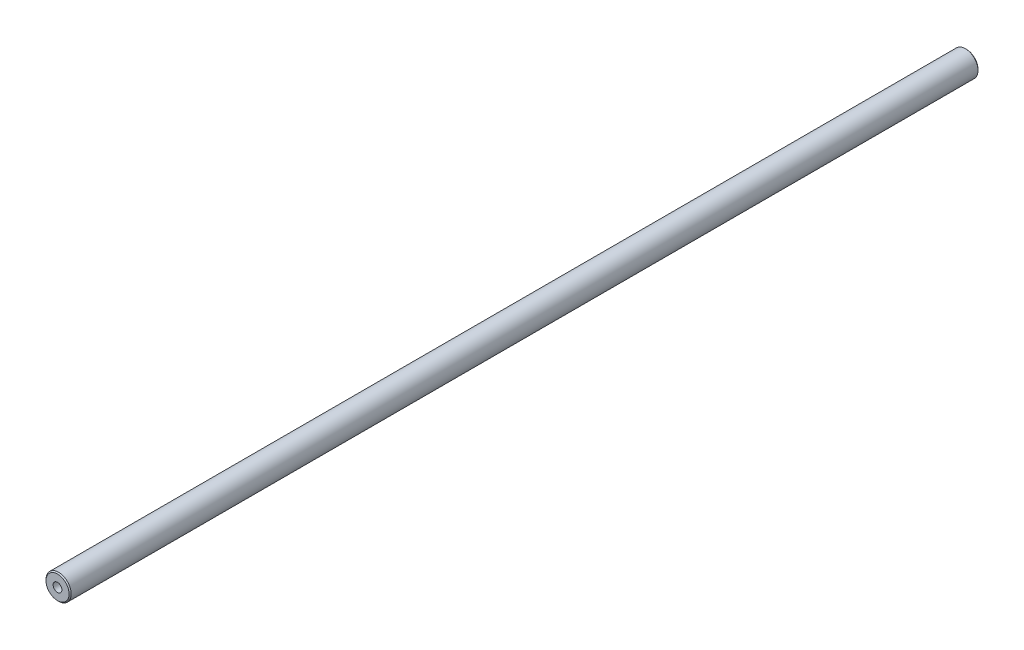
ISO-10303-21;
HEADER;
FILE_DESCRIPTION(('STEP AP214'),'2;1');
FILE_NAME('part.step','',(''),(''),'','','');
FILE_SCHEMA(('AUTOMOTIVE_DESIGN { 1 0 10303 214 1 1 1 1 }'));
ENDSEC;
DATA;
#1=APPLICATION_CONTEXT('core data for automotive mechanical design processes');
#2=APPLICATION_PROTOCOL_DEFINITION('international standard','automotive_design',2000,#1);
#3=PRODUCT_CONTEXT('',#1,'mechanical');
#4=PRODUCT('Part','Part','',(#3));
#5=PRODUCT_RELATED_PRODUCT_CATEGORY('part','',(#4));
#6=PRODUCT_DEFINITION_FORMATION('','',#4);
#7=PRODUCT_DEFINITION_CONTEXT('part definition',#1,'design');
#8=PRODUCT_DEFINITION('design','',#6,#7);
#9=PRODUCT_DEFINITION_SHAPE('','',#8);
#10=(LENGTH_UNIT() NAMED_UNIT(*) SI_UNIT(.MILLI.,.METRE.));
#11=(NAMED_UNIT(*) PLANE_ANGLE_UNIT() SI_UNIT($,.RADIAN.));
#12=(NAMED_UNIT(*) SI_UNIT($,.STERADIAN.) SOLID_ANGLE_UNIT());
#13=UNCERTAINTY_MEASURE_WITH_UNIT(LENGTH_MEASURE(1.E-05),#10,'distance_accuracy_value','');
#14=(GEOMETRIC_REPRESENTATION_CONTEXT(3) GLOBAL_UNCERTAINTY_ASSIGNED_CONTEXT((#13)) GLOBAL_UNIT_ASSIGNED_CONTEXT((#10,
#11,#12)) REPRESENTATION_CONTEXT('',''));
#15=CARTESIAN_POINT('',(0.,0.,0.));
#16=DIRECTION('',(0.,0.,1.));
#17=DIRECTION('',(1.,0.,0.));
#18=AXIS2_PLACEMENT_3D('',#15,#16,#17);
#19=CARTESIAN_POINT('',(0.,0.,450.451642748477));
#20=DIRECTION('',(0.,0.,-1.));
#21=DIRECTION('',(-1.,0.,0.));
#22=AXIS2_PLACEMENT_3D('',#19,#20,#21);
#23=CYLINDRICAL_SURFACE('',#22,6.);
#24=CARTESIAN_POINT('',(0.,0.,0.499999999999945));
#25=DIRECTION('',(0.,0.,1.));
#26=DIRECTION('',(1.,0.,0.));
#27=AXIS2_PLACEMENT_3D('',#24,#25,#26);
#28=CIRCLE('',#27,6.);
#29=CARTESIAN_POINT('',(6.,0.,0.499999999999945));
#30=VERTEX_POINT('',#29);
#31=EDGE_CURVE('E117',#30,#30,#28,.T.);
#32=ORIENTED_EDGE('',*,*,#31,.T.);
#33=EDGE_LOOP('',(#32));
#34=FACE_BOUND('',#33,.T.);
#35=CARTESIAN_POINT('',(0.,0.,432.98108));
#36=DIRECTION('',(0.,0.,1.));
#37=DIRECTION('',(1.,0.,0.));
#38=AXIS2_PLACEMENT_3D('',#35,#36,#37);
#39=CIRCLE('',#38,6.);
#40=CARTESIAN_POINT('',(6.,0.,432.98108));
#41=VERTEX_POINT('',#40);
#42=EDGE_CURVE('E110',#41,#41,#39,.F.);
#43=ORIENTED_EDGE('',*,*,#42,.T.);
#44=EDGE_LOOP('',(#43));
#45=FACE_BOUND('',#44,.T.);
#46=ADVANCED_FACE('F50',(#34,#45),#23,.T.);
#47=CARTESIAN_POINT('',(0.,0.,0.));
#48=DIRECTION('',(0.,0.,1.));
#49=DIRECTION('',(1.,0.,0.));
#50=AXIS2_PLACEMENT_3D('',#47,#48,#49);
#51=PLANE('',#50);
#52=CARTESIAN_POINT('',(0.,0.,0.));
#53=DIRECTION('',(0.,0.,-1.));
#54=DIRECTION('',(-1.,0.,0.));
#55=AXIS2_PLACEMENT_3D('',#52,#53,#54);
#56=CIRCLE('',#55,2.09999999999999);
#57=CARTESIAN_POINT('',(-2.09999999999999,0.,0.));
#58=VERTEX_POINT('',#57);
#59=EDGE_CURVE('E77',#58,#58,#56,.T.);
#60=ORIENTED_EDGE('',*,*,#59,.F.);
#61=EDGE_LOOP('',(#60));
#62=FACE_BOUND('',#61,.T.);
#63=CARTESIAN_POINT('',(0.,0.,0.));
#64=DIRECTION('',(0.,0.,1.));
#65=DIRECTION('',(1.,0.,0.));
#66=AXIS2_PLACEMENT_3D('',#63,#64,#65);
#67=CIRCLE('',#66,5.50000000000006);
#68=CARTESIAN_POINT('',(5.50000000000006,0.,0.));
#69=VERTEX_POINT('',#68);
#70=EDGE_CURVE('E60',#69,#69,#67,.F.);
#71=ORIENTED_EDGE('',*,*,#70,.T.);
#72=EDGE_LOOP('',(#71));
#73=FACE_BOUND('',#72,.T.);
#74=ADVANCED_FACE('F126',(#62,#73),#51,.F.);
#75=CARTESIAN_POINT('',(-150.,-206.762159999996,433.48108));
#76=DIRECTION('',(0.,0.,1.));
#77=DIRECTION('',(0.,-1.,0.));
#78=AXIS2_PLACEMENT_3D('',#75,#76,#77);
#79=PLANE('',#78);
#80=CARTESIAN_POINT('',(0.,0.,433.48108));
#81=DIRECTION('',(0.,0.,1.));
#82=DIRECTION('',(0.,-1.,0.));
#83=AXIS2_PLACEMENT_3D('',#80,#81,#82);
#84=CIRCLE('',#83,2.09999999999999);
#85=CARTESIAN_POINT('',(0.,-2.10000000000003,433.48108));
#86=VERTEX_POINT('',#85);
#87=EDGE_CURVE('E78',#86,#86,#84,.T.);
#88=ORIENTED_EDGE('',*,*,#87,.F.);
#89=EDGE_LOOP('',(#88));
#90=FACE_BOUND('',#89,.T.);
#91=CARTESIAN_POINT('',(0.,0.,433.48108));
#92=DIRECTION('',(0.,0.,1.));
#93=DIRECTION('',(0.,-1.,0.));
#94=AXIS2_PLACEMENT_3D('',#91,#92,#93);
#95=CIRCLE('',#94,5.50000000000006);
#96=CARTESIAN_POINT('',(0.,-5.5000000000001,433.48108));
#97=VERTEX_POINT('',#96);
#98=EDGE_CURVE('E13',#97,#97,#95,.T.);
#99=ORIENTED_EDGE('',*,*,#98,.T.);
#100=EDGE_LOOP('',(#99));
#101=FACE_BOUND('',#100,.T.);
#102=ADVANCED_FACE('F131',(#90,#101),#79,.T.);
#103=CARTESIAN_POINT('',(0.,0.,0.499999999999945));
#104=DIRECTION('',(0.,0.,1.));
#105=DIRECTION('',(1.,0.,0.));
#106=AXIS2_PLACEMENT_3D('',#103,#104,#105);
#107=CONICAL_SURFACE('',#106,6.,0.785398163397443);
#108=ORIENTED_EDGE('',*,*,#70,.F.);
#109=EDGE_LOOP('',(#108));
#110=FACE_BOUND('',#109,.T.);
#111=ORIENTED_EDGE('',*,*,#31,.F.);
#112=EDGE_LOOP('',(#111));
#113=FACE_BOUND('',#112,.T.);
#114=ADVANCED_FACE('F128',(#110,#113),#107,.T.);
#115=CARTESIAN_POINT('',(0.,0.,433.48108));
#116=DIRECTION('',(0.,0.,-1.));
#117=DIRECTION('',(-1.,0.,0.));
#118=AXIS2_PLACEMENT_3D('',#115,#116,#117);
#119=CONICAL_SURFACE('',#118,5.50000000000006,0.785398163397444);
#120=ORIENTED_EDGE('',*,*,#42,.F.);
#121=EDGE_LOOP('',(#120));
#122=FACE_BOUND('',#121,.T.);
#123=ORIENTED_EDGE('',*,*,#98,.F.);
#124=EDGE_LOOP('',(#123));
#125=FACE_BOUND('',#124,.T.);
#126=ADVANCED_FACE('F52',(#122,#125),#119,.T.);
#127=CARTESIAN_POINT('',(0.,0.,16.4));
#128=DIRECTION('',(0.,0.,-1.));
#129=DIRECTION('',(-1.,0.,0.));
#130=AXIS2_PLACEMENT_3D('',#127,#128,#129);
#131=CONICAL_SURFACE('',#130,2.1,1.02974425867665);
#132=CARTESIAN_POINT('',(0.,0.,17.6618072999579));
#133=VERTEX_POINT('',#132);
#134=VERTEX_LOOP('',#133);
#135=FACE_BOUND('',#134,.T.);
#136=CARTESIAN_POINT('',(0.,0.,16.4));
#137=DIRECTION('',(0.,0.,-1.));
#138=DIRECTION('',(-1.,0.,0.));
#139=AXIS2_PLACEMENT_3D('',#136,#137,#138);
#140=CIRCLE('',#139,2.1);
#141=CARTESIAN_POINT('',(-2.1,0.,16.4));
#142=VERTEX_POINT('',#141);
#143=EDGE_CURVE('E84',#142,#142,#140,.T.);
#144=ORIENTED_EDGE('',*,*,#143,.T.);
#145=EDGE_LOOP('',(#144));
#146=FACE_BOUND('',#145,.T.);
#147=ADVANCED_FACE('F142',(#135,#146),#131,.F.);
#148=CARTESIAN_POINT('',(0.,0.,0.));
#149=DIRECTION('',(0.,0.,-1.));
#150=DIRECTION('',(-1.,0.,0.));
#151=AXIS2_PLACEMENT_3D('',#148,#149,#150);
#152=CYLINDRICAL_SURFACE('',#151,2.09999999999999);
#153=ORIENTED_EDGE('',*,*,#143,.F.);
#154=EDGE_LOOP('',(#153));
#155=FACE_BOUND('',#154,.T.);
#156=ORIENTED_EDGE('',*,*,#59,.T.);
#157=EDGE_LOOP('',(#156));
#158=FACE_BOUND('',#157,.T.);
#159=ADVANCED_FACE('F70',(#155,#158),#152,.F.);
#160=CARTESIAN_POINT('',(0.,0.,417.08108));
#161=DIRECTION('',(0.,0.,1.));
#162=DIRECTION('',(0.,-1.,0.));
#163=AXIS2_PLACEMENT_3D('',#160,#161,#162);
#164=CONICAL_SURFACE('',#163,2.1,1.02974425867665);
#165=CARTESIAN_POINT('',(0.,0.,415.819272700042));
#166=VERTEX_POINT('',#165);
#167=VERTEX_LOOP('',#166);
#168=FACE_BOUND('',#167,.T.);
#169=CARTESIAN_POINT('',(0.,0.,417.08108));
#170=DIRECTION('',(0.,0.,1.));
#171=DIRECTION('',(0.,-1.,0.));
#172=AXIS2_PLACEMENT_3D('',#169,#170,#171);
#173=CIRCLE('',#172,2.1);
#174=CARTESIAN_POINT('',(0.,-2.10000000000004,417.08108));
#175=VERTEX_POINT('',#174);
#176=EDGE_CURVE('E74',#175,#175,#173,.T.);
#177=ORIENTED_EDGE('',*,*,#176,.T.);
#178=EDGE_LOOP('',(#177));
#179=FACE_BOUND('',#178,.T.);
#180=ADVANCED_FACE('F66',(#168,#179),#164,.F.);
#181=CARTESIAN_POINT('',(0.,0.,433.48108));
#182=DIRECTION('',(0.,0.,1.));
#183=DIRECTION('',(0.,-1.,0.));
#184=AXIS2_PLACEMENT_3D('',#181,#182,#183);
#185=CYLINDRICAL_SURFACE('',#184,2.09999999999999);
#186=ORIENTED_EDGE('',*,*,#176,.F.);
#187=EDGE_LOOP('',(#186));
#188=FACE_BOUND('',#187,.T.);
#189=ORIENTED_EDGE('',*,*,#87,.T.);
#190=EDGE_LOOP('',(#189));
#191=FACE_BOUND('',#190,.T.);
#192=ADVANCED_FACE('F69',(#188,#191),#185,.F.);
#193=CLOSED_SHELL('',(#46,#74,#102,#114,#126,#147,#159,#180,#192));
#194=MANIFOLD_SOLID_BREP('B2',#193);
#195=ADVANCED_BREP_SHAPE_REPRESENTATION('',(#18,#194),#14);
#196=SHAPE_DEFINITION_REPRESENTATION(#9,#195);
ENDSEC;
END-ISO-10303-21;
